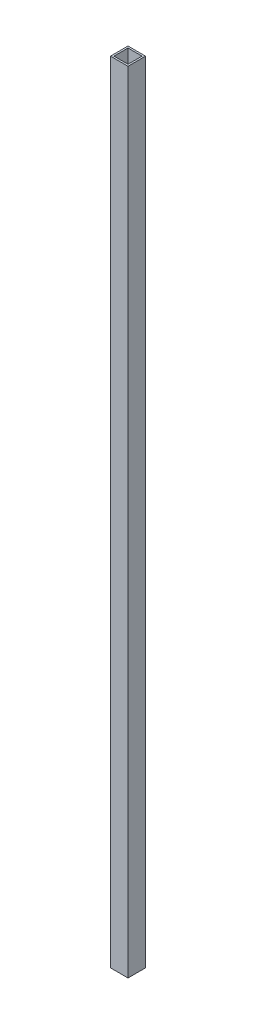
ISO-10303-21;
HEADER;
FILE_DESCRIPTION(('STEP AP214'),'2;1');
FILE_NAME('part.step','',(''),(''),'','','');
FILE_SCHEMA(('AUTOMOTIVE_DESIGN { 1 0 10303 214 1 1 1 1 }'));
ENDSEC;
DATA;
#1=APPLICATION_CONTEXT('core data for automotive mechanical design processes');
#2=APPLICATION_PROTOCOL_DEFINITION('international standard','automotive_design',2000,#1);
#3=PRODUCT_CONTEXT('',#1,'mechanical');
#4=PRODUCT('Part','Part','',(#3));
#5=PRODUCT_RELATED_PRODUCT_CATEGORY('part','',(#4));
#6=PRODUCT_DEFINITION_FORMATION('','',#4);
#7=PRODUCT_DEFINITION_CONTEXT('part definition',#1,'design');
#8=PRODUCT_DEFINITION('design','',#6,#7);
#9=PRODUCT_DEFINITION_SHAPE('','',#8);
#10=(LENGTH_UNIT() NAMED_UNIT(*) SI_UNIT(.MILLI.,.METRE.));
#11=(NAMED_UNIT(*) PLANE_ANGLE_UNIT() SI_UNIT($,.RADIAN.));
#12=(NAMED_UNIT(*) SI_UNIT($,.STERADIAN.) SOLID_ANGLE_UNIT());
#13=UNCERTAINTY_MEASURE_WITH_UNIT(LENGTH_MEASURE(1.E-05),#10,'distance_accuracy_value','');
#14=(GEOMETRIC_REPRESENTATION_CONTEXT(3) GLOBAL_UNCERTAINTY_ASSIGNED_CONTEXT((#13)) GLOBAL_UNIT_ASSIGNED_CONTEXT((#10,
#11,#12)) REPRESENTATION_CONTEXT('',''));
#15=CARTESIAN_POINT('',(0.,0.,0.));
#16=DIRECTION('',(0.,0.,1.));
#17=DIRECTION('',(1.,0.,0.));
#18=AXIS2_PLACEMENT_3D('',#15,#16,#17);
#19=CARTESIAN_POINT('',(-31.7391304347827,49.7826086956523,-20.));
#20=DIRECTION('',(-1.,0.,0.));
#21=DIRECTION('',(0.,-1.,0.));
#22=AXIS2_PLACEMENT_3D('',#19,#20,#21);
#23=PLANE('',#22);
#24=DIRECTION('',(0.,-1.,0.));
#25=VECTOR('',#24,1.);
#26=CARTESIAN_POINT('',(-31.7391304347827,49.7826086956523,0.));
#27=LINE('',#26,#25);
#28=CARTESIAN_POINT('',(-31.7391304347827,49.7826086956523,0.));
#29=VERTEX_POINT('',#28);
#30=CARTESIAN_POINT('',(-31.7391304347826,-850.217391304348,0.));
#31=VERTEX_POINT('',#30);
#32=EDGE_CURVE('E157',#29,#31,#27,.T.);
#33=ORIENTED_EDGE('',*,*,#32,.F.);
#34=DIRECTION('',(0.,0.,1.));
#35=VECTOR('',#34,1.);
#36=CARTESIAN_POINT('',(-31.7391304347827,49.7826086956523,-20.));
#37=LINE('',#36,#35);
#38=CARTESIAN_POINT('',(-31.7391304347827,49.7826086956523,-20.));
#39=VERTEX_POINT('',#38);
#40=EDGE_CURVE('E11',#39,#29,#37,.T.);
#41=ORIENTED_EDGE('',*,*,#40,.F.);
#42=DIRECTION('',(0.,-1.,0.));
#43=VECTOR('',#42,1.);
#44=CARTESIAN_POINT('',(-31.7391304347827,49.7826086956523,-20.));
#45=LINE('',#44,#43);
#46=CARTESIAN_POINT('',(-31.7391304347826,-850.217391304348,-20.));
#47=VERTEX_POINT('',#46);
#48=EDGE_CURVE('E163',#39,#47,#45,.T.);
#49=ORIENTED_EDGE('',*,*,#48,.T.);
#50=DIRECTION('',(0.,0.,1.));
#51=VECTOR('',#50,1.);
#52=CARTESIAN_POINT('',(-31.7391304347826,-850.217391304348,-20.));
#53=LINE('',#52,#51);
#54=EDGE_CURVE('E42',#47,#31,#53,.T.);
#55=ORIENTED_EDGE('',*,*,#54,.T.);
#56=EDGE_LOOP('',(#33,#41,#49,#55));
#57=FACE_BOUND('',#56,.T.);
#58=ADVANCED_FACE('F39',(#57),#23,.T.);
#59=CARTESIAN_POINT('',(-31.7391304347827,49.7826086956523,-20.));
#60=DIRECTION('',(0.,1.,0.));
#61=DIRECTION('',(0.,0.,1.));
#62=AXIS2_PLACEMENT_3D('',#59,#60,#61);
#63=PLANE('',#62);
#64=DIRECTION('',(0.,0.,1.));
#65=VECTOR('',#64,1.);
#66=CARTESIAN_POINT('',(-29.7391304347827,49.7826086956523,-18.));
#67=LINE('',#66,#65);
#68=CARTESIAN_POINT('',(-29.7391304347827,49.7826086956523,-18.));
#69=VERTEX_POINT('',#68);
#70=CARTESIAN_POINT('',(-29.7391304347827,49.7826086956523,-2.));
#71=VERTEX_POINT('',#70);
#72=EDGE_CURVE('E56',#69,#71,#67,.T.);
#73=ORIENTED_EDGE('',*,*,#72,.F.);
#74=DIRECTION('',(-1.,0.,0.));
#75=VECTOR('',#74,1.);
#76=CARTESIAN_POINT('',(-13.7391304347827,49.7826086956523,-18.));
#77=LINE('',#76,#75);
#78=CARTESIAN_POINT('',(-13.7391304347827,49.7826086956523,-18.));
#79=VERTEX_POINT('',#78);
#80=EDGE_CURVE('E135',#79,#69,#77,.T.);
#81=ORIENTED_EDGE('',*,*,#80,.F.);
#82=DIRECTION('',(0.,0.,-1.));
#83=VECTOR('',#82,1.);
#84=CARTESIAN_POINT('',(-13.7391304347827,49.7826086956523,-2.));
#85=LINE('',#84,#83);
#86=CARTESIAN_POINT('',(-13.7391304347827,49.7826086956523,-2.));
#87=VERTEX_POINT('',#86);
#88=EDGE_CURVE('E139',#87,#79,#85,.T.);
#89=ORIENTED_EDGE('',*,*,#88,.F.);
#90=DIRECTION('',(1.,0.,0.));
#91=VECTOR('',#90,1.);
#92=CARTESIAN_POINT('',(-29.7391304347827,49.7826086956523,-2.));
#93=LINE('',#92,#91);
#94=EDGE_CURVE('E148',#71,#87,#93,.T.);
#95=ORIENTED_EDGE('',*,*,#94,.F.);
#96=EDGE_LOOP('',(#73,#81,#89,#95));
#97=FACE_BOUND('',#96,.T.);
#98=DIRECTION('',(-1.,0.,0.));
#99=VECTOR('',#98,1.);
#100=CARTESIAN_POINT('',(-31.7391304347827,49.7826086956523,0.));
#101=LINE('',#100,#99);
#102=CARTESIAN_POINT('',(-11.7391304347827,49.7826086956523,0.));
#103=VERTEX_POINT('',#102);
#104=EDGE_CURVE('E167',#103,#29,#101,.T.);
#105=ORIENTED_EDGE('',*,*,#104,.F.);
#106=DIRECTION('',(0.,0.,1.));
#107=VECTOR('',#106,1.);
#108=CARTESIAN_POINT('',(-11.7391304347827,49.7826086956523,-20.));
#109=LINE('',#108,#107);
#110=CARTESIAN_POINT('',(-11.7391304347827,49.7826086956523,-20.));
#111=VERTEX_POINT('',#110);
#112=EDGE_CURVE('E48',#111,#103,#109,.T.);
#113=ORIENTED_EDGE('',*,*,#112,.F.);
#114=DIRECTION('',(-1.,0.,0.));
#115=VECTOR('',#114,1.);
#116=CARTESIAN_POINT('',(-31.7391304347827,49.7826086956523,-20.));
#117=LINE('',#116,#115);
#118=EDGE_CURVE('E174',#111,#39,#117,.T.);
#119=ORIENTED_EDGE('',*,*,#118,.T.);
#120=ORIENTED_EDGE('',*,*,#40,.T.);
#121=EDGE_LOOP('',(#105,#113,#119,#120));
#122=FACE_BOUND('',#121,.T.);
#123=ADVANCED_FACE('F199',(#97,#122),#63,.T.);
#124=CARTESIAN_POINT('',(-11.7391304347827,49.7826086956523,-20.));
#125=DIRECTION('',(1.,0.,0.));
#126=DIRECTION('',(0.,1.,0.));
#127=AXIS2_PLACEMENT_3D('',#124,#125,#126);
#128=PLANE('',#127);
#129=DIRECTION('',(0.,1.,0.));
#130=VECTOR('',#129,1.);
#131=CARTESIAN_POINT('',(-11.7391304347827,49.7826086956523,0.));
#132=LINE('',#131,#130);
#133=CARTESIAN_POINT('',(-11.7391304347826,-850.217391304348,0.));
#134=VERTEX_POINT('',#133);
#135=EDGE_CURVE('E184',#134,#103,#132,.T.);
#136=ORIENTED_EDGE('',*,*,#135,.F.);
#137=DIRECTION('',(0.,0.,1.));
#138=VECTOR('',#137,1.);
#139=CARTESIAN_POINT('',(-11.7391304347826,-850.217391304348,-20.));
#140=LINE('',#139,#138);
#141=CARTESIAN_POINT('',(-11.7391304347826,-850.217391304348,-20.));
#142=VERTEX_POINT('',#141);
#143=EDGE_CURVE('E192',#142,#134,#140,.T.);
#144=ORIENTED_EDGE('',*,*,#143,.F.);
#145=DIRECTION('',(0.,1.,0.));
#146=VECTOR('',#145,1.);
#147=CARTESIAN_POINT('',(-11.7391304347827,49.7826086956523,-20.));
#148=LINE('',#147,#146);
#149=EDGE_CURVE('E170',#142,#111,#148,.T.);
#150=ORIENTED_EDGE('',*,*,#149,.T.);
#151=ORIENTED_EDGE('',*,*,#112,.T.);
#152=EDGE_LOOP('',(#136,#144,#150,#151));
#153=FACE_BOUND('',#152,.T.);
#154=ADVANCED_FACE('F203',(#153),#128,.T.);
#155=CARTESIAN_POINT('',(-31.7391304347826,-850.217391304348,-20.));
#156=DIRECTION('',(0.,-1.,0.));
#157=DIRECTION('',(0.,0.,-1.));
#158=AXIS2_PLACEMENT_3D('',#155,#156,#157);
#159=PLANE('',#158);
#160=DIRECTION('',(1.,0.,0.));
#161=VECTOR('',#160,1.);
#162=CARTESIAN_POINT('',(-31.7391304347826,-850.217391304348,0.));
#163=LINE('',#162,#161);
#164=EDGE_CURVE('E180',#31,#134,#163,.T.);
#165=ORIENTED_EDGE('',*,*,#164,.F.);
#166=ORIENTED_EDGE('',*,*,#54,.F.);
#167=DIRECTION('',(1.,0.,0.));
#168=VECTOR('',#167,1.);
#169=CARTESIAN_POINT('',(-31.7391304347826,-850.217391304348,-20.));
#170=LINE('',#169,#168);
#171=EDGE_CURVE('E166',#47,#142,#170,.T.);
#172=ORIENTED_EDGE('',*,*,#171,.T.);
#173=ORIENTED_EDGE('',*,*,#143,.T.);
#174=EDGE_LOOP('',(#165,#166,#172,#173));
#175=FACE_BOUND('',#174,.T.);
#176=ADVANCED_FACE('F196',(#175),#159,.T.);
#177=CARTESIAN_POINT('',(0.,0.,-20.));
#178=DIRECTION('',(0.,0.,1.));
#179=DIRECTION('',(1.,0.,0.));
#180=AXIS2_PLACEMENT_3D('',#177,#178,#179);
#181=PLANE('',#180);
#182=ORIENTED_EDGE('',*,*,#48,.F.);
#183=ORIENTED_EDGE('',*,*,#118,.F.);
#184=ORIENTED_EDGE('',*,*,#149,.F.);
#185=ORIENTED_EDGE('',*,*,#171,.F.);
#186=EDGE_LOOP('',(#182,#183,#184,#185));
#187=FACE_BOUND('',#186,.T.);
#188=ADVANCED_FACE('F205',(#187),#181,.F.);
#189=CARTESIAN_POINT('',(0.,0.,0.));
#190=DIRECTION('',(0.,0.,1.));
#191=DIRECTION('',(1.,0.,0.));
#192=AXIS2_PLACEMENT_3D('',#189,#190,#191);
#193=PLANE('',#192);
#194=ORIENTED_EDGE('',*,*,#32,.T.);
#195=ORIENTED_EDGE('',*,*,#164,.T.);
#196=ORIENTED_EDGE('',*,*,#135,.T.);
#197=ORIENTED_EDGE('',*,*,#104,.T.);
#198=EDGE_LOOP('',(#194,#195,#196,#197));
#199=FACE_BOUND('',#198,.T.);
#200=ADVANCED_FACE('F198',(#199),#193,.T.);
#201=CARTESIAN_POINT('',(-29.7391304347827,-150.217391304348,-18.));
#202=DIRECTION('',(-1.,0.,0.));
#203=DIRECTION('',(0.,0.,1.));
#204=AXIS2_PLACEMENT_3D('',#201,#202,#203);
#205=PLANE('',#204);
#206=ORIENTED_EDGE('',*,*,#72,.T.);
#207=DIRECTION('',(0.,1.,0.));
#208=VECTOR('',#207,1.);
#209=CARTESIAN_POINT('',(-29.7391304347827,-150.217391304348,-2.));
#210=LINE('',#209,#208);
#211=CARTESIAN_POINT('',(-29.7391304347827,-150.217391304348,-2.));
#212=VERTEX_POINT('',#211);
#213=EDGE_CURVE('E110',#212,#71,#210,.T.);
#214=ORIENTED_EDGE('',*,*,#213,.F.);
#215=DIRECTION('',(0.,0.,1.));
#216=VECTOR('',#215,1.);
#217=CARTESIAN_POINT('',(-29.7391304347827,-150.217391304348,-18.));
#218=LINE('',#217,#216);
#219=CARTESIAN_POINT('',(-29.7391304347827,-150.217391304348,-18.));
#220=VERTEX_POINT('',#219);
#221=EDGE_CURVE('E114',#220,#212,#218,.T.);
#222=ORIENTED_EDGE('',*,*,#221,.F.);
#223=DIRECTION('',(0.,1.,0.));
#224=VECTOR('',#223,1.);
#225=CARTESIAN_POINT('',(-29.7391304347827,-150.217391304348,-18.));
#226=LINE('',#225,#224);
#227=EDGE_CURVE('E154',#220,#69,#226,.T.);
#228=ORIENTED_EDGE('',*,*,#227,.T.);
#229=EDGE_LOOP('',(#206,#214,#222,#228));
#230=FACE_BOUND('',#229,.T.);
#231=ADVANCED_FACE('F112',(#230),#205,.F.);
#232=CARTESIAN_POINT('',(-13.7391304347827,-150.217391304348,-18.));
#233=DIRECTION('',(0.,0.,-1.));
#234=DIRECTION('',(-1.,0.,0.));
#235=AXIS2_PLACEMENT_3D('',#232,#233,#234);
#236=PLANE('',#235);
#237=ORIENTED_EDGE('',*,*,#80,.T.);
#238=ORIENTED_EDGE('',*,*,#227,.F.);
#239=DIRECTION('',(-1.,0.,0.));
#240=VECTOR('',#239,1.);
#241=CARTESIAN_POINT('',(-13.7391304347827,-150.217391304348,-18.));
#242=LINE('',#241,#240);
#243=CARTESIAN_POINT('',(-13.7391304347827,-150.217391304348,-18.));
#244=VERTEX_POINT('',#243);
#245=EDGE_CURVE('E121',#244,#220,#242,.T.);
#246=ORIENTED_EDGE('',*,*,#245,.F.);
#247=DIRECTION('',(0.,1.,0.));
#248=VECTOR('',#247,1.);
#249=CARTESIAN_POINT('',(-13.7391304347827,-150.217391304348,-18.));
#250=LINE('',#249,#248);
#251=EDGE_CURVE('E158',#244,#79,#250,.T.);
#252=ORIENTED_EDGE('',*,*,#251,.T.);
#253=EDGE_LOOP('',(#237,#238,#246,#252));
#254=FACE_BOUND('',#253,.T.);
#255=ADVANCED_FACE('F229',(#254),#236,.F.);
#256=CARTESIAN_POINT('',(-13.7391304347827,-150.217391304348,-2.));
#257=DIRECTION('',(1.,0.,0.));
#258=DIRECTION('',(0.,0.,-1.));
#259=AXIS2_PLACEMENT_3D('',#256,#257,#258);
#260=PLANE('',#259);
#261=ORIENTED_EDGE('',*,*,#88,.T.);
#262=ORIENTED_EDGE('',*,*,#251,.F.);
#263=DIRECTION('',(0.,0.,-1.));
#264=VECTOR('',#263,1.);
#265=CARTESIAN_POINT('',(-13.7391304347827,-150.217391304348,-2.));
#266=LINE('',#265,#264);
#267=CARTESIAN_POINT('',(-13.7391304347827,-150.217391304348,-2.));
#268=VERTEX_POINT('',#267);
#269=EDGE_CURVE('E130',#268,#244,#266,.T.);
#270=ORIENTED_EDGE('',*,*,#269,.F.);
#271=DIRECTION('',(0.,1.,0.));
#272=VECTOR('',#271,1.);
#273=CARTESIAN_POINT('',(-13.7391304347827,-150.217391304348,-2.));
#274=LINE('',#273,#272);
#275=EDGE_CURVE('E120',#268,#87,#274,.T.);
#276=ORIENTED_EDGE('',*,*,#275,.T.);
#277=EDGE_LOOP('',(#261,#262,#270,#276));
#278=FACE_BOUND('',#277,.T.);
#279=ADVANCED_FACE('F227',(#278),#260,.F.);
#280=CARTESIAN_POINT('',(-29.7391304347827,-150.217391304348,-2.));
#281=DIRECTION('',(0.,0.,1.));
#282=DIRECTION('',(1.,0.,0.));
#283=AXIS2_PLACEMENT_3D('',#280,#281,#282);
#284=PLANE('',#283);
#285=ORIENTED_EDGE('',*,*,#94,.T.);
#286=ORIENTED_EDGE('',*,*,#275,.F.);
#287=DIRECTION('',(1.,0.,0.));
#288=VECTOR('',#287,1.);
#289=CARTESIAN_POINT('',(-29.7391304347827,-150.217391304348,-2.));
#290=LINE('',#289,#288);
#291=EDGE_CURVE('E124',#212,#268,#290,.T.);
#292=ORIENTED_EDGE('',*,*,#291,.F.);
#293=ORIENTED_EDGE('',*,*,#213,.T.);
#294=EDGE_LOOP('',(#285,#286,#292,#293));
#295=FACE_BOUND('',#294,.T.);
#296=ADVANCED_FACE('F125',(#295),#284,.F.);
#297=CARTESIAN_POINT('',(0.,-150.217391304348,0.));
#298=DIRECTION('',(0.,1.,0.));
#299=DIRECTION('',(0.,0.,1.));
#300=AXIS2_PLACEMENT_3D('',#297,#298,#299);
#301=PLANE('',#300);
#302=ORIENTED_EDGE('',*,*,#221,.T.);
#303=ORIENTED_EDGE('',*,*,#291,.T.);
#304=ORIENTED_EDGE('',*,*,#269,.T.);
#305=ORIENTED_EDGE('',*,*,#245,.T.);
#306=EDGE_LOOP('',(#302,#303,#304,#305));
#307=FACE_BOUND('',#306,.T.);
#308=ADVANCED_FACE('F132',(#307),#301,.T.);
#309=CLOSED_SHELL('',(#58,#123,#154,#176,#188,#200,#231,#255,#279,#296,#308));
#310=MANIFOLD_SOLID_BREP('B2',#309);
#311=ADVANCED_BREP_SHAPE_REPRESENTATION('',(#18,#310),#14);
#312=SHAPE_DEFINITION_REPRESENTATION(#9,#311);
ENDSEC;
END-ISO-10303-21;
